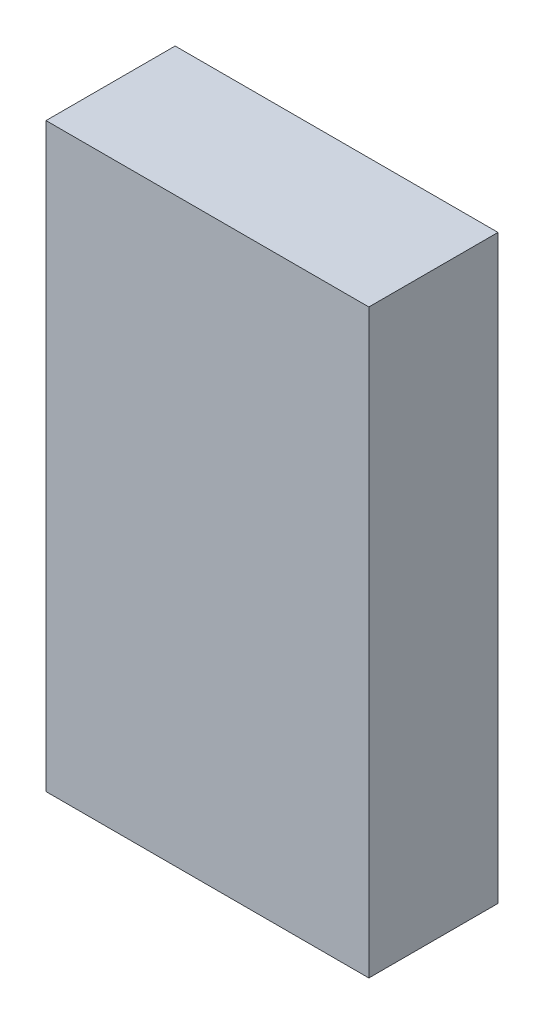
ISO-10303-21;
HEADER;
FILE_DESCRIPTION(('STEP AP214'),'2;1');
FILE_NAME('part.step','',(''),(''),'','','');
FILE_SCHEMA(('AUTOMOTIVE_DESIGN { 1 0 10303 214 1 1 1 1 }'));
ENDSEC;
DATA;
#1=APPLICATION_CONTEXT('core data for automotive mechanical design processes');
#2=APPLICATION_PROTOCOL_DEFINITION('international standard','automotive_design',2000,#1);
#3=PRODUCT_CONTEXT('',#1,'mechanical');
#4=PRODUCT('Part','Part','',(#3));
#5=PRODUCT_RELATED_PRODUCT_CATEGORY('part','',(#4));
#6=PRODUCT_DEFINITION_FORMATION('','',#4);
#7=PRODUCT_DEFINITION_CONTEXT('part definition',#1,'design');
#8=PRODUCT_DEFINITION('design','',#6,#7);
#9=PRODUCT_DEFINITION_SHAPE('','',#8);
#10=(LENGTH_UNIT() NAMED_UNIT(*) SI_UNIT(.MILLI.,.METRE.));
#11=(NAMED_UNIT(*) PLANE_ANGLE_UNIT() SI_UNIT($,.RADIAN.));
#12=(NAMED_UNIT(*) SI_UNIT($,.STERADIAN.) SOLID_ANGLE_UNIT());
#13=UNCERTAINTY_MEASURE_WITH_UNIT(LENGTH_MEASURE(1.E-05),#10,'distance_accuracy_value','');
#14=(GEOMETRIC_REPRESENTATION_CONTEXT(3) GLOBAL_UNCERTAINTY_ASSIGNED_CONTEXT((#13)) GLOBAL_UNIT_ASSIGNED_CONTEXT((#10,
#11,#12)) REPRESENTATION_CONTEXT('',''));
#15=CARTESIAN_POINT('',(0.,0.,0.));
#16=DIRECTION('',(0.,0.,1.));
#17=DIRECTION('',(1.,0.,0.));
#18=AXIS2_PLACEMENT_3D('',#15,#16,#17);
#19=CARTESIAN_POINT('',(-0.625,-2.05,0.));
#20=DIRECTION('',(1.,0.,0.));
#21=DIRECTION('',(0.,0.,1.));
#22=AXIS2_PLACEMENT_3D('',#19,#20,#21);
#23=PLANE('',#22);
#24=DIRECTION('',(0.,1.,0.));
#25=VECTOR('',#24,1.);
#26=CARTESIAN_POINT('',(-0.625,-2.05,0.1));
#27=LINE('',#26,#25);
#28=CARTESIAN_POINT('',(-0.625,-2.05,0.1));
#29=VERTEX_POINT('',#28);
#30=CARTESIAN_POINT('',(-0.625,-1.6,0.1));
#31=VERTEX_POINT('',#30);
#32=EDGE_CURVE('E11',#29,#31,#27,.T.);
#33=ORIENTED_EDGE('',*,*,#32,.T.);
#34=DIRECTION('',(0.,0.,1.));
#35=VECTOR('',#34,1.);
#36=CARTESIAN_POINT('',(-0.625,-1.6,0.));
#37=LINE('',#36,#35);
#38=CARTESIAN_POINT('',(-0.625,-1.6,0.));
#39=VERTEX_POINT('',#38);
#40=EDGE_CURVE('E24',#39,#31,#37,.T.);
#41=ORIENTED_EDGE('',*,*,#40,.F.);
#42=DIRECTION('',(0.,1.,0.));
#43=VECTOR('',#42,1.);
#44=CARTESIAN_POINT('',(-0.625,-2.05,0.));
#45=LINE('',#44,#43);
#46=CARTESIAN_POINT('',(-0.625,-2.05,0.));
#47=VERTEX_POINT('',#46);
#48=EDGE_CURVE('E86',#47,#39,#45,.T.);
#49=ORIENTED_EDGE('',*,*,#48,.F.);
#50=DIRECTION('',(0.,0.,1.));
#51=VECTOR('',#50,1.);
#52=CARTESIAN_POINT('',(-0.625,-2.05,0.));
#53=LINE('',#52,#51);
#54=EDGE_CURVE('E36',#47,#29,#53,.T.);
#55=ORIENTED_EDGE('',*,*,#54,.T.);
#56=EDGE_LOOP('',(#33,#41,#49,#55));
#57=FACE_BOUND('',#56,.T.);
#58=ADVANCED_FACE('F17',(#57),#23,.F.);
#59=CARTESIAN_POINT('',(-0.375,-2.05,0.));
#60=DIRECTION('',(1.,0.,0.));
#61=DIRECTION('',(0.,0.,1.));
#62=AXIS2_PLACEMENT_3D('',#59,#60,#61);
#63=PLANE('',#62);
#64=DIRECTION('',(0.,0.,1.));
#65=VECTOR('',#64,1.);
#66=CARTESIAN_POINT('',(-0.375,-2.05,0.));
#67=LINE('',#66,#65);
#68=CARTESIAN_POINT('',(-0.375,-2.05,0.));
#69=VERTEX_POINT('',#68);
#70=CARTESIAN_POINT('',(-0.375,-2.05,0.1));
#71=VERTEX_POINT('',#70);
#72=EDGE_CURVE('E83',#69,#71,#67,.T.);
#73=ORIENTED_EDGE('',*,*,#72,.F.);
#74=DIRECTION('',(0.,1.,0.));
#75=VECTOR('',#74,1.);
#76=CARTESIAN_POINT('',(-0.375,-2.05,0.));
#77=LINE('',#76,#75);
#78=CARTESIAN_POINT('',(-0.375,-1.6,0.));
#79=VERTEX_POINT('',#78);
#80=EDGE_CURVE('E63',#69,#79,#77,.T.);
#81=ORIENTED_EDGE('',*,*,#80,.T.);
#82=DIRECTION('',(0.,0.,1.));
#83=VECTOR('',#82,1.);
#84=CARTESIAN_POINT('',(-0.375,-1.6,0.));
#85=LINE('',#84,#83);
#86=CARTESIAN_POINT('',(-0.375,-1.6,0.1));
#87=VERTEX_POINT('',#86);
#88=EDGE_CURVE('E57',#79,#87,#85,.T.);
#89=ORIENTED_EDGE('',*,*,#88,.T.);
#90=DIRECTION('',(0.,1.,0.));
#91=VECTOR('',#90,1.);
#92=CARTESIAN_POINT('',(-0.375,-2.05,0.1));
#93=LINE('',#92,#91);
#94=EDGE_CURVE('E60',#71,#87,#93,.T.);
#95=ORIENTED_EDGE('',*,*,#94,.F.);
#96=EDGE_LOOP('',(#73,#81,#89,#95));
#97=FACE_BOUND('',#96,.T.);
#98=ADVANCED_FACE('F59',(#97),#63,.T.);
#99=CARTESIAN_POINT('',(-0.625,-2.05,0.));
#100=DIRECTION('',(0.,1.,0.));
#101=DIRECTION('',(0.,0.,1.));
#102=AXIS2_PLACEMENT_3D('',#99,#100,#101);
#103=PLANE('',#102);
#104=ORIENTED_EDGE('',*,*,#72,.T.);
#105=DIRECTION('',(1.,0.,0.));
#106=VECTOR('',#105,1.);
#107=CARTESIAN_POINT('',(-0.625,-2.05,0.1));
#108=LINE('',#107,#106);
#109=EDGE_CURVE('E71',#29,#71,#108,.T.);
#110=ORIENTED_EDGE('',*,*,#109,.F.);
#111=ORIENTED_EDGE('',*,*,#54,.F.);
#112=DIRECTION('',(1.,0.,0.));
#113=VECTOR('',#112,1.);
#114=CARTESIAN_POINT('',(-0.625,-2.05,0.));
#115=LINE('',#114,#113);
#116=EDGE_CURVE('E76',#47,#69,#115,.T.);
#117=ORIENTED_EDGE('',*,*,#116,.T.);
#118=EDGE_LOOP('',(#104,#110,#111,#117));
#119=FACE_BOUND('',#118,.T.);
#120=ADVANCED_FACE('F91',(#119),#103,.F.);
#121=CARTESIAN_POINT('',(-0.625,-1.6,0.));
#122=DIRECTION('',(0.,1.,0.));
#123=DIRECTION('',(0.,0.,1.));
#124=AXIS2_PLACEMENT_3D('',#121,#122,#123);
#125=PLANE('',#124);
#126=DIRECTION('',(1.,0.,0.));
#127=VECTOR('',#126,1.);
#128=CARTESIAN_POINT('',(-0.625,-1.6,0.));
#129=LINE('',#128,#127);
#130=EDGE_CURVE('E74',#39,#79,#129,.T.);
#131=ORIENTED_EDGE('',*,*,#130,.F.);
#132=ORIENTED_EDGE('',*,*,#40,.T.);
#133=DIRECTION('',(1.,0.,0.));
#134=VECTOR('',#133,1.);
#135=CARTESIAN_POINT('',(-0.625,-1.6,0.1));
#136=LINE('',#135,#134);
#137=EDGE_CURVE('E69',#31,#87,#136,.T.);
#138=ORIENTED_EDGE('',*,*,#137,.T.);
#139=ORIENTED_EDGE('',*,*,#88,.F.);
#140=EDGE_LOOP('',(#131,#132,#138,#139));
#141=FACE_BOUND('',#140,.T.);
#142=ADVANCED_FACE('F73',(#141),#125,.T.);
#143=CARTESIAN_POINT('',(-0.625,-2.05,0.));
#144=DIRECTION('',(0.,0.,1.));
#145=DIRECTION('',(1.,0.,0.));
#146=AXIS2_PLACEMENT_3D('',#143,#144,#145);
#147=PLANE('',#146);
#148=ORIENTED_EDGE('',*,*,#130,.T.);
#149=ORIENTED_EDGE('',*,*,#80,.F.);
#150=ORIENTED_EDGE('',*,*,#116,.F.);
#151=ORIENTED_EDGE('',*,*,#48,.T.);
#152=EDGE_LOOP('',(#148,#149,#150,#151));
#153=FACE_BOUND('',#152,.T.);
#154=ADVANCED_FACE('F89',(#153),#147,.F.);
#155=CARTESIAN_POINT('',(-0.625,-2.05,0.1));
#156=DIRECTION('',(0.,0.,1.));
#157=DIRECTION('',(1.,0.,0.));
#158=AXIS2_PLACEMENT_3D('',#155,#156,#157);
#159=PLANE('',#158);
#160=ORIENTED_EDGE('',*,*,#32,.F.);
#161=ORIENTED_EDGE('',*,*,#109,.T.);
#162=ORIENTED_EDGE('',*,*,#94,.T.);
#163=ORIENTED_EDGE('',*,*,#137,.F.);
#164=EDGE_LOOP('',(#160,#161,#162,#163));
#165=FACE_BOUND('',#164,.T.);
#166=ADVANCED_FACE('F68',(#165),#159,.T.);
#167=CLOSED_SHELL('',(#58,#98,#120,#142,#154,#166));
#168=MANIFOLD_SOLID_BREP('B1',#167);
#169=ADVANCED_BREP_SHAPE_REPRESENTATION('',(#18,#168),#14);
#170=SHAPE_DEFINITION_REPRESENTATION(#9,#169);
ENDSEC;
END-ISO-10303-21;
